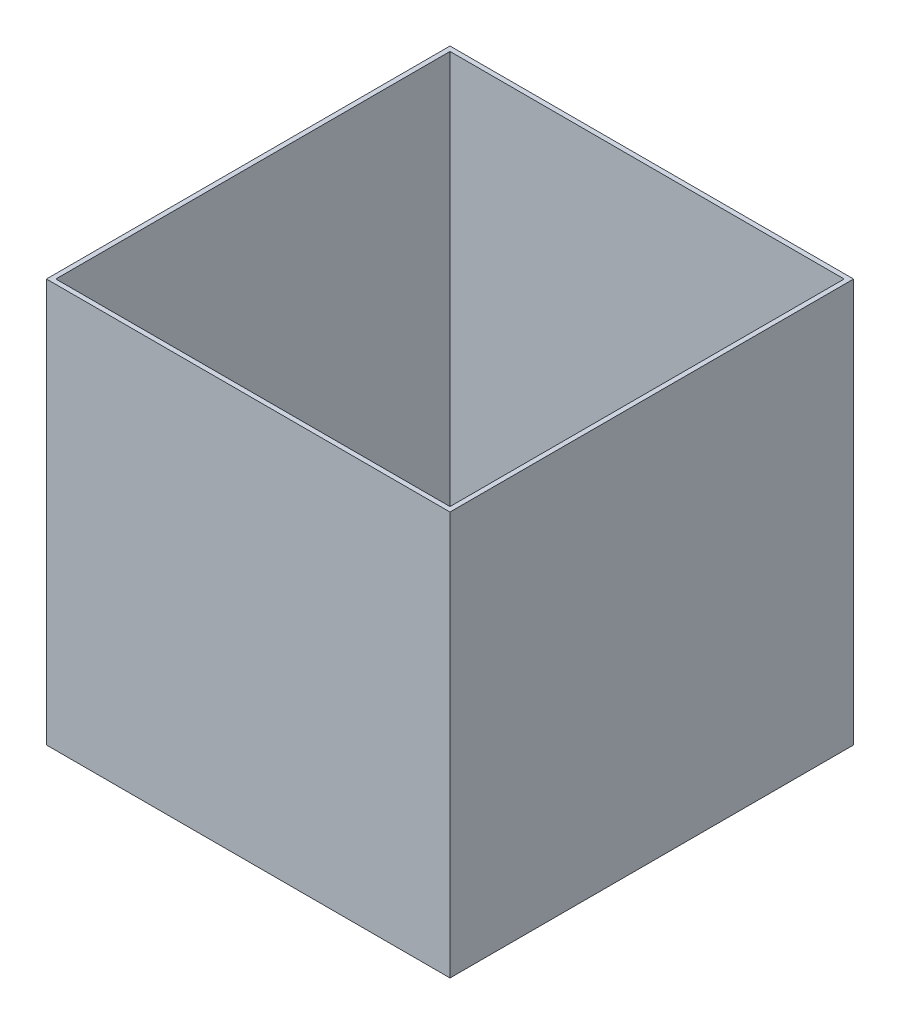
ISO-10303-21;
HEADER;
FILE_DESCRIPTION(('STEP AP214'),'2;1');
FILE_NAME('part.step','',(''),(''),'','','');
FILE_SCHEMA(('AUTOMOTIVE_DESIGN { 1 0 10303 214 1 1 1 1 }'));
ENDSEC;
DATA;
#1=APPLICATION_CONTEXT('core data for automotive mechanical design processes');
#2=APPLICATION_PROTOCOL_DEFINITION('international standard','automotive_design',2000,#1);
#3=PRODUCT_CONTEXT('',#1,'mechanical');
#4=PRODUCT('Part','Part','',(#3));
#5=PRODUCT_RELATED_PRODUCT_CATEGORY('part','',(#4));
#6=PRODUCT_DEFINITION_FORMATION('','',#4);
#7=PRODUCT_DEFINITION_CONTEXT('part definition',#1,'design');
#8=PRODUCT_DEFINITION('design','',#6,#7);
#9=PRODUCT_DEFINITION_SHAPE('','',#8);
#10=(LENGTH_UNIT() NAMED_UNIT(*) SI_UNIT(.MILLI.,.METRE.));
#11=(NAMED_UNIT(*) PLANE_ANGLE_UNIT() SI_UNIT($,.RADIAN.));
#12=(NAMED_UNIT(*) SI_UNIT($,.STERADIAN.) SOLID_ANGLE_UNIT());
#13=UNCERTAINTY_MEASURE_WITH_UNIT(LENGTH_MEASURE(1.E-05),#10,'distance_accuracy_value','');
#14=(GEOMETRIC_REPRESENTATION_CONTEXT(3) GLOBAL_UNCERTAINTY_ASSIGNED_CONTEXT((#13)) GLOBAL_UNIT_ASSIGNED_CONTEXT((#10,
#11,#12)) REPRESENTATION_CONTEXT('',''));
#15=CARTESIAN_POINT('',(0.,0.,0.));
#16=DIRECTION('',(0.,0.,1.));
#17=DIRECTION('',(1.,0.,0.));
#18=AXIS2_PLACEMENT_3D('',#15,#16,#17);
#19=CARTESIAN_POINT('',(-30.,60.,30.));
#20=DIRECTION('',(1.,0.,0.));
#21=DIRECTION('',(0.,0.,-1.));
#22=AXIS2_PLACEMENT_3D('',#19,#20,#21);
#23=PLANE('',#22);
#24=DIRECTION('',(0.,0.,1.));
#25=VECTOR('',#24,1.);
#26=CARTESIAN_POINT('',(-30.,0.,30.));
#27=LINE('',#26,#25);
#28=CARTESIAN_POINT('',(-30.,0.,-30.));
#29=VERTEX_POINT('',#28);
#30=CARTESIAN_POINT('',(-30.,0.,30.));
#31=VERTEX_POINT('',#30);
#32=EDGE_CURVE('E147',#29,#31,#27,.T.);
#33=ORIENTED_EDGE('',*,*,#32,.T.);
#34=DIRECTION('',(0.,-1.,0.));
#35=VECTOR('',#34,1.);
#36=CARTESIAN_POINT('',(-30.,60.,30.));
#37=LINE('',#36,#35);
#38=CARTESIAN_POINT('',(-30.,60.,30.));
#39=VERTEX_POINT('',#38);
#40=EDGE_CURVE('E11',#39,#31,#37,.T.);
#41=ORIENTED_EDGE('',*,*,#40,.F.);
#42=DIRECTION('',(0.,0.,1.));
#43=VECTOR('',#42,1.);
#44=CARTESIAN_POINT('',(-30.,60.,30.));
#45=LINE('',#44,#43);
#46=CARTESIAN_POINT('',(-30.,60.,-30.));
#47=VERTEX_POINT('',#46);
#48=EDGE_CURVE('E140',#47,#39,#45,.T.);
#49=ORIENTED_EDGE('',*,*,#48,.F.);
#50=DIRECTION('',(0.,-1.,0.));
#51=VECTOR('',#50,1.);
#52=CARTESIAN_POINT('',(-30.,60.,-30.));
#53=LINE('',#52,#51);
#54=EDGE_CURVE('E146',#47,#29,#53,.T.);
#55=ORIENTED_EDGE('',*,*,#54,.T.);
#56=EDGE_LOOP('',(#33,#41,#49,#55));
#57=FACE_BOUND('',#56,.T.);
#58=ADVANCED_FACE('F33',(#57),#23,.F.);
#59=CARTESIAN_POINT('',(30.,60.,30.));
#60=DIRECTION('',(0.,0.,-1.));
#61=DIRECTION('',(-1.,0.,0.));
#62=AXIS2_PLACEMENT_3D('',#59,#60,#61);
#63=PLANE('',#62);
#64=DIRECTION('',(1.,0.,0.));
#65=VECTOR('',#64,1.);
#66=CARTESIAN_POINT('',(30.,0.,30.));
#67=LINE('',#66,#65);
#68=CARTESIAN_POINT('',(30.,0.,30.));
#69=VERTEX_POINT('',#68);
#70=EDGE_CURVE('E150',#31,#69,#67,.T.);
#71=ORIENTED_EDGE('',*,*,#70,.T.);
#72=DIRECTION('',(0.,-1.,0.));
#73=VECTOR('',#72,1.);
#74=CARTESIAN_POINT('',(30.,60.,30.));
#75=LINE('',#74,#73);
#76=CARTESIAN_POINT('',(30.,60.,30.));
#77=VERTEX_POINT('',#76);
#78=EDGE_CURVE('E40',#77,#69,#75,.T.);
#79=ORIENTED_EDGE('',*,*,#78,.F.);
#80=DIRECTION('',(1.,0.,0.));
#81=VECTOR('',#80,1.);
#82=CARTESIAN_POINT('',(30.,60.,30.));
#83=LINE('',#82,#81);
#84=EDGE_CURVE('E84',#39,#77,#83,.T.);
#85=ORIENTED_EDGE('',*,*,#84,.F.);
#86=ORIENTED_EDGE('',*,*,#40,.T.);
#87=EDGE_LOOP('',(#71,#79,#85,#86));
#88=FACE_BOUND('',#87,.T.);
#89=ADVANCED_FACE('F179',(#88),#63,.F.);
#90=CARTESIAN_POINT('',(30.,60.,30.));
#91=DIRECTION('',(-1.,0.,0.));
#92=DIRECTION('',(0.,0.,1.));
#93=AXIS2_PLACEMENT_3D('',#90,#91,#92);
#94=PLANE('',#93);
#95=DIRECTION('',(0.,0.,-1.));
#96=VECTOR('',#95,1.);
#97=CARTESIAN_POINT('',(30.,0.,30.));
#98=LINE('',#97,#96);
#99=CARTESIAN_POINT('',(30.,0.,-30.));
#100=VERTEX_POINT('',#99);
#101=EDGE_CURVE('E152',#69,#100,#98,.T.);
#102=ORIENTED_EDGE('',*,*,#101,.T.);
#103=DIRECTION('',(0.,-1.,0.));
#104=VECTOR('',#103,1.);
#105=CARTESIAN_POINT('',(30.,60.,-30.));
#106=LINE('',#105,#104);
#107=CARTESIAN_POINT('',(30.,60.,-30.));
#108=VERTEX_POINT('',#107);
#109=EDGE_CURVE('E156',#108,#100,#106,.T.);
#110=ORIENTED_EDGE('',*,*,#109,.F.);
#111=DIRECTION('',(0.,0.,-1.));
#112=VECTOR('',#111,1.);
#113=CARTESIAN_POINT('',(30.,60.,30.));
#114=LINE('',#113,#112);
#115=EDGE_CURVE('E143',#77,#108,#114,.T.);
#116=ORIENTED_EDGE('',*,*,#115,.F.);
#117=ORIENTED_EDGE('',*,*,#78,.T.);
#118=EDGE_LOOP('',(#102,#110,#116,#117));
#119=FACE_BOUND('',#118,.T.);
#120=ADVANCED_FACE('F161',(#119),#94,.F.);
#121=CARTESIAN_POINT('',(30.,60.,-30.));
#122=DIRECTION('',(0.,0.,1.));
#123=DIRECTION('',(1.,0.,0.));
#124=AXIS2_PLACEMENT_3D('',#121,#122,#123);
#125=PLANE('',#124);
#126=DIRECTION('',(-1.,0.,0.));
#127=VECTOR('',#126,1.);
#128=CARTESIAN_POINT('',(30.,0.,-30.));
#129=LINE('',#128,#127);
#130=EDGE_CURVE('E77',#100,#29,#129,.T.);
#131=ORIENTED_EDGE('',*,*,#130,.T.);
#132=ORIENTED_EDGE('',*,*,#54,.F.);
#133=DIRECTION('',(-1.,0.,0.));
#134=VECTOR('',#133,1.);
#135=CARTESIAN_POINT('',(30.,60.,-30.));
#136=LINE('',#135,#134);
#137=EDGE_CURVE('E56',#108,#47,#136,.T.);
#138=ORIENTED_EDGE('',*,*,#137,.F.);
#139=ORIENTED_EDGE('',*,*,#109,.T.);
#140=EDGE_LOOP('',(#131,#132,#138,#139));
#141=FACE_BOUND('',#140,.T.);
#142=ADVANCED_FACE('F169',(#141),#125,.F.);
#143=CARTESIAN_POINT('',(0.,60.,0.));
#144=DIRECTION('',(0.,1.,0.));
#145=DIRECTION('',(0.,0.,1.));
#146=AXIS2_PLACEMENT_3D('',#143,#144,#145);
#147=PLANE('',#146);
#148=DIRECTION('',(0.,0.,1.));
#149=VECTOR('',#148,1.);
#150=CARTESIAN_POINT('',(-29.3,60.,30.));
#151=LINE('',#150,#149);
#152=CARTESIAN_POINT('',(-29.3,60.,-29.3));
#153=VERTEX_POINT('',#152);
#154=CARTESIAN_POINT('',(-29.3,60.,29.3));
#155=VERTEX_POINT('',#154);
#156=EDGE_CURVE('E129',#153,#155,#151,.T.);
#157=ORIENTED_EDGE('',*,*,#156,.F.);
#158=DIRECTION('',(-1.,0.,0.));
#159=VECTOR('',#158,1.);
#160=CARTESIAN_POINT('',(30.,60.,-29.3));
#161=LINE('',#160,#159);
#162=CARTESIAN_POINT('',(29.3,60.,-29.3));
#163=VERTEX_POINT('',#162);
#164=EDGE_CURVE('E138',#163,#153,#161,.T.);
#165=ORIENTED_EDGE('',*,*,#164,.F.);
#166=DIRECTION('',(0.,0.,-1.));
#167=VECTOR('',#166,1.);
#168=CARTESIAN_POINT('',(29.3,60.,30.));
#169=LINE('',#168,#167);
#170=CARTESIAN_POINT('',(29.3,60.,29.3));
#171=VERTEX_POINT('',#170);
#172=EDGE_CURVE('E136',#171,#163,#169,.T.);
#173=ORIENTED_EDGE('',*,*,#172,.F.);
#174=DIRECTION('',(1.,0.,0.));
#175=VECTOR('',#174,1.);
#176=CARTESIAN_POINT('',(30.,60.,29.3));
#177=LINE('',#176,#175);
#178=EDGE_CURVE('E121',#155,#171,#177,.T.);
#179=ORIENTED_EDGE('',*,*,#178,.F.);
#180=EDGE_LOOP('',(#157,#165,#173,#179));
#181=FACE_BOUND('',#180,.T.);
#182=ORIENTED_EDGE('',*,*,#48,.T.);
#183=ORIENTED_EDGE('',*,*,#84,.T.);
#184=ORIENTED_EDGE('',*,*,#115,.T.);
#185=ORIENTED_EDGE('',*,*,#137,.T.);
#186=EDGE_LOOP('',(#182,#183,#184,#185));
#187=FACE_BOUND('',#186,.T.);
#188=ADVANCED_FACE('F171',(#181,#187),#147,.T.);
#189=CARTESIAN_POINT('',(0.,0.,0.));
#190=DIRECTION('',(0.,1.,0.));
#191=DIRECTION('',(0.,0.,1.));
#192=AXIS2_PLACEMENT_3D('',#189,#190,#191);
#193=PLANE('',#192);
#194=ORIENTED_EDGE('',*,*,#32,.F.);
#195=ORIENTED_EDGE('',*,*,#130,.F.);
#196=ORIENTED_EDGE('',*,*,#101,.F.);
#197=ORIENTED_EDGE('',*,*,#70,.F.);
#198=EDGE_LOOP('',(#194,#195,#196,#197));
#199=FACE_BOUND('',#198,.T.);
#200=ADVANCED_FACE('F165',(#199),#193,.F.);
#201=CARTESIAN_POINT('',(-29.3,60.,30.));
#202=DIRECTION('',(1.,0.,0.));
#203=DIRECTION('',(0.,0.,-1.));
#204=AXIS2_PLACEMENT_3D('',#201,#202,#203);
#205=PLANE('',#204);
#206=DIRECTION('',(0.,0.,1.));
#207=VECTOR('',#206,1.);
#208=CARTESIAN_POINT('',(-29.3,0.699999999999999,30.));
#209=LINE('',#208,#207);
#210=CARTESIAN_POINT('',(-29.3,0.7,-29.3));
#211=VERTEX_POINT('',#210);
#212=CARTESIAN_POINT('',(-29.3,0.7,29.3));
#213=VERTEX_POINT('',#212);
#214=EDGE_CURVE('E112',#211,#213,#209,.T.);
#215=ORIENTED_EDGE('',*,*,#214,.F.);
#216=DIRECTION('',(0.,-1.,0.));
#217=VECTOR('',#216,1.);
#218=CARTESIAN_POINT('',(-29.3,60.,-29.3));
#219=LINE('',#218,#217);
#220=EDGE_CURVE('E132',#153,#211,#219,.T.);
#221=ORIENTED_EDGE('',*,*,#220,.F.);
#222=ORIENTED_EDGE('',*,*,#156,.T.);
#223=DIRECTION('',(0.,-1.,0.));
#224=VECTOR('',#223,1.);
#225=CARTESIAN_POINT('',(-29.3,60.,29.3));
#226=LINE('',#225,#224);
#227=EDGE_CURVE('E124',#155,#213,#226,.T.);
#228=ORIENTED_EDGE('',*,*,#227,.T.);
#229=EDGE_LOOP('',(#215,#221,#222,#228));
#230=FACE_BOUND('',#229,.T.);
#231=ADVANCED_FACE('F206',(#230),#205,.T.);
#232=CARTESIAN_POINT('',(30.,60.,29.3));
#233=DIRECTION('',(0.,0.,-1.));
#234=DIRECTION('',(-1.,0.,0.));
#235=AXIS2_PLACEMENT_3D('',#232,#233,#234);
#236=PLANE('',#235);
#237=DIRECTION('',(1.,0.,0.));
#238=VECTOR('',#237,1.);
#239=CARTESIAN_POINT('',(30.,0.699999999999999,29.3));
#240=LINE('',#239,#238);
#241=CARTESIAN_POINT('',(29.3,0.7,29.3));
#242=VERTEX_POINT('',#241);
#243=EDGE_CURVE('E106',#213,#242,#240,.T.);
#244=ORIENTED_EDGE('',*,*,#243,.F.);
#245=ORIENTED_EDGE('',*,*,#227,.F.);
#246=ORIENTED_EDGE('',*,*,#178,.T.);
#247=DIRECTION('',(0.,-1.,0.));
#248=VECTOR('',#247,1.);
#249=CARTESIAN_POINT('',(29.3,60.,29.3));
#250=LINE('',#249,#248);
#251=EDGE_CURVE('E118',#171,#242,#250,.T.);
#252=ORIENTED_EDGE('',*,*,#251,.T.);
#253=EDGE_LOOP('',(#244,#245,#246,#252));
#254=FACE_BOUND('',#253,.T.);
#255=ADVANCED_FACE('F119',(#254),#236,.T.);
#256=CARTESIAN_POINT('',(29.3,60.,30.));
#257=DIRECTION('',(-1.,0.,0.));
#258=DIRECTION('',(0.,0.,1.));
#259=AXIS2_PLACEMENT_3D('',#256,#257,#258);
#260=PLANE('',#259);
#261=DIRECTION('',(0.,0.,-1.));
#262=VECTOR('',#261,1.);
#263=CARTESIAN_POINT('',(29.3,0.699999999999999,30.));
#264=LINE('',#263,#262);
#265=CARTESIAN_POINT('',(29.3,0.7,-29.3));
#266=VERTEX_POINT('',#265);
#267=EDGE_CURVE('E110',#242,#266,#264,.T.);
#268=ORIENTED_EDGE('',*,*,#267,.F.);
#269=ORIENTED_EDGE('',*,*,#251,.F.);
#270=ORIENTED_EDGE('',*,*,#172,.T.);
#271=DIRECTION('',(0.,-1.,0.));
#272=VECTOR('',#271,1.);
#273=CARTESIAN_POINT('',(29.3,60.,-29.3));
#274=LINE('',#273,#272);
#275=EDGE_CURVE('E47',#163,#266,#274,.T.);
#276=ORIENTED_EDGE('',*,*,#275,.T.);
#277=EDGE_LOOP('',(#268,#269,#270,#276));
#278=FACE_BOUND('',#277,.T.);
#279=ADVANCED_FACE('F126',(#278),#260,.T.);
#280=CARTESIAN_POINT('',(30.,60.,-29.3));
#281=DIRECTION('',(0.,0.,1.));
#282=DIRECTION('',(1.,0.,0.));
#283=AXIS2_PLACEMENT_3D('',#280,#281,#282);
#284=PLANE('',#283);
#285=DIRECTION('',(-1.,0.,0.));
#286=VECTOR('',#285,1.);
#287=CARTESIAN_POINT('',(30.,0.699999999999999,-29.3));
#288=LINE('',#287,#286);
#289=EDGE_CURVE('E127',#266,#211,#288,.T.);
#290=ORIENTED_EDGE('',*,*,#289,.F.);
#291=ORIENTED_EDGE('',*,*,#275,.F.);
#292=ORIENTED_EDGE('',*,*,#164,.T.);
#293=ORIENTED_EDGE('',*,*,#220,.T.);
#294=EDGE_LOOP('',(#290,#291,#292,#293));
#295=FACE_BOUND('',#294,.T.);
#296=ADVANCED_FACE('F236',(#295),#284,.T.);
#297=CARTESIAN_POINT('',(0.,0.7,0.));
#298=DIRECTION('',(0.,1.,0.));
#299=DIRECTION('',(0.,0.,1.));
#300=AXIS2_PLACEMENT_3D('',#297,#298,#299);
#301=PLANE('',#300);
#302=ORIENTED_EDGE('',*,*,#214,.T.);
#303=ORIENTED_EDGE('',*,*,#243,.T.);
#304=ORIENTED_EDGE('',*,*,#267,.T.);
#305=ORIENTED_EDGE('',*,*,#289,.T.);
#306=EDGE_LOOP('',(#302,#303,#304,#305));
#307=FACE_BOUND('',#306,.T.);
#308=ADVANCED_FACE('F108',(#307),#301,.T.);
#309=CLOSED_SHELL('',(#58,#89,#120,#142,#188,#200,#231,#255,#279,#296,#308));
#310=MANIFOLD_SOLID_BREP('B2',#309);
#311=ADVANCED_BREP_SHAPE_REPRESENTATION('',(#18,#310),#14);
#312=SHAPE_DEFINITION_REPRESENTATION(#9,#311);
ENDSEC;
END-ISO-10303-21;
